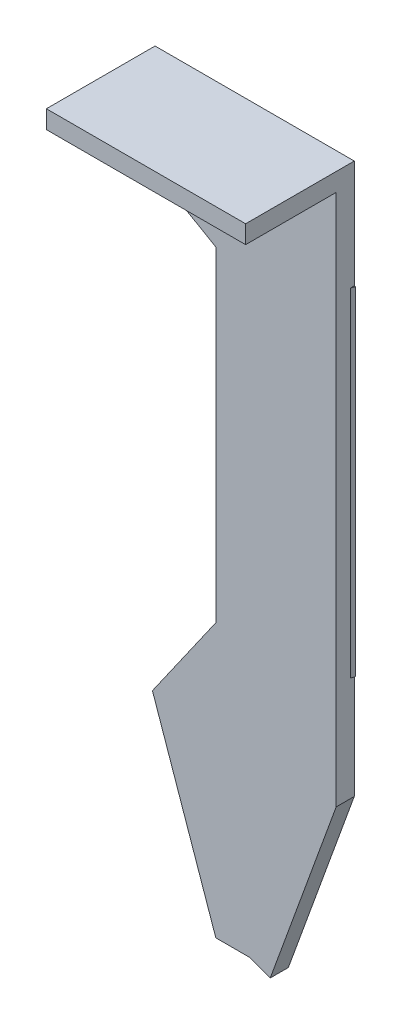
ISO-10303-21;
HEADER;
FILE_DESCRIPTION(('STEP AP214'),'2;1');
FILE_NAME('part.step','',(''),(''),'','','');
FILE_SCHEMA(('AUTOMOTIVE_DESIGN { 1 0 10303 214 1 1 1 1 }'));
ENDSEC;
DATA;
#1=APPLICATION_CONTEXT('core data for automotive mechanical design processes');
#2=APPLICATION_PROTOCOL_DEFINITION('international standard','automotive_design',2000,#1);
#3=PRODUCT_CONTEXT('',#1,'mechanical');
#4=PRODUCT('Part','Part','',(#3));
#5=PRODUCT_RELATED_PRODUCT_CATEGORY('part','',(#4));
#6=PRODUCT_DEFINITION_FORMATION('','',#4);
#7=PRODUCT_DEFINITION_CONTEXT('part definition',#1,'design');
#8=PRODUCT_DEFINITION('design','',#6,#7);
#9=PRODUCT_DEFINITION_SHAPE('','',#8);
#10=(LENGTH_UNIT() NAMED_UNIT(*) SI_UNIT(.MILLI.,.METRE.));
#11=(NAMED_UNIT(*) PLANE_ANGLE_UNIT() SI_UNIT($,.RADIAN.));
#12=(NAMED_UNIT(*) SI_UNIT($,.STERADIAN.) SOLID_ANGLE_UNIT());
#13=UNCERTAINTY_MEASURE_WITH_UNIT(LENGTH_MEASURE(1.E-05),#10,'distance_accuracy_value','');
#14=(GEOMETRIC_REPRESENTATION_CONTEXT(3) GLOBAL_UNCERTAINTY_ASSIGNED_CONTEXT((#13)) GLOBAL_UNIT_ASSIGNED_CONTEXT((#10,
#11,#12)) REPRESENTATION_CONTEXT('',''));
#15=CARTESIAN_POINT('',(0.,0.,0.));
#16=DIRECTION('',(0.,0.,1.));
#17=DIRECTION('',(1.,0.,0.));
#18=AXIS2_PLACEMENT_3D('',#15,#16,#17);
#19=CARTESIAN_POINT('',(95.289553246,-32.363508327,33.5));
#20=DIRECTION('',(0.,0.,-1.));
#21=DIRECTION('',(-1.,0.,0.));
#22=AXIS2_PLACEMENT_3D('',#19,#20,#21);
#23=PLANE('',#22);
#24=DIRECTION('',(1.,0.,0.));
#25=VECTOR('',#24,1.);
#26=CARTESIAN_POINT('',(84.289553246,-32.363508327,33.5));
#27=LINE('',#26,#25);
#28=CARTESIAN_POINT('',(73.289553246,-32.3635083263106,33.5));
#29=VERTEX_POINT('',#28);
#30=CARTESIAN_POINT('',(95.289553246,-32.363508327,33.5));
#31=VERTEX_POINT('',#30);
#32=EDGE_CURVE('E151',#29,#31,#27,.T.);
#33=ORIENTED_EDGE('',*,*,#32,.T.);
#34=DIRECTION('',(0.,1.,0.));
#35=VECTOR('',#34,1.);
#36=CARTESIAN_POINT('',(95.289553246,-60.748418779,33.5));
#37=LINE('',#36,#35);
#38=CARTESIAN_POINT('',(95.289553246,-30.363508327,33.5));
#39=VERTEX_POINT('',#38);
#40=EDGE_CURVE('E145',#31,#39,#37,.T.);
#41=ORIENTED_EDGE('',*,*,#40,.T.);
#42=DIRECTION('',(1.,0.,0.));
#43=VECTOR('',#42,1.);
#44=CARTESIAN_POINT('',(84.289553246,-30.363508327,33.5));
#45=LINE('',#44,#43);
#46=CARTESIAN_POINT('',(73.289553246,-30.363508327,33.5));
#47=VERTEX_POINT('',#46);
#48=EDGE_CURVE('E197',#47,#39,#45,.T.);
#49=ORIENTED_EDGE('',*,*,#48,.F.);
#50=DIRECTION('',(0.,-1.,0.));
#51=VECTOR('',#50,1.);
#52=CARTESIAN_POINT('',(73.289553246,-34.2040161205,33.5));
#53=LINE('',#52,#51);
#54=EDGE_CURVE('E177',#47,#29,#53,.T.);
#55=ORIENTED_EDGE('',*,*,#54,.T.);
#56=EDGE_LOOP('',(#33,#41,#49,#55));
#57=FACE_BOUND('',#56,.T.);
#58=ADVANCED_FACE('F19',(#57),#23,.F.);
#59=CARTESIAN_POINT('',(95.437373304,-79.599792462,21.895386265));
#60=DIRECTION('',(0.,1.,0.));
#61=DIRECTION('',(0.,0.,-1.));
#62=AXIS2_PLACEMENT_3D('',#59,#60,#61);
#63=PLANE('',#62);
#64=DIRECTION('',(1.,0.,0.));
#65=VECTOR('',#64,1.);
#66=CARTESIAN_POINT('',(84.3630224595,-79.5997924755307,21.5));
#67=LINE('',#66,#65);
#68=CARTESIAN_POINT('',(95.2895532471578,-79.5997924716139,21.5));
#69=VERTEX_POINT('',#68);
#70=CARTESIAN_POINT('',(95.4364916730518,-79.5997924687654,21.5));
#71=VERTEX_POINT('',#70);
#72=EDGE_CURVE('E242',#69,#71,#67,.T.);
#73=ORIENTED_EDGE('',*,*,#72,.T.);
#74=CARTESIAN_POINT('',(93.5,-79.599792462,20.9999999999999));
#75=DIRECTION('',(0.,-1.,0.));
#76=DIRECTION('',(0.,0.,-1.));
#77=AXIS2_PLACEMENT_3D('',#74,#75,#76);
#78=CIRCLE('',#77,2.);
#79=CARTESIAN_POINT('',(95.289553246,-79.5997924662727,21.8930280938559));
#80=VERTEX_POINT('',#79);
#81=EDGE_CURVE('E399',#71,#80,#78,.T.);
#82=ORIENTED_EDGE('',*,*,#81,.T.);
#83=DIRECTION('',(0.,0.,-1.));
#84=VECTOR('',#83,1.);
#85=CARTESIAN_POINT('',(95.289553246,-79.5997924705455,27.5));
#86=LINE('',#85,#84);
#87=EDGE_CURVE('E209',#80,#69,#86,.T.);
#88=ORIENTED_EDGE('',*,*,#87,.T.);
#89=EDGE_LOOP('',(#73,#82,#88));
#90=FACE_BOUND('',#89,.T.);
#91=ADVANCED_FACE('F814',(#90),#63,.F.);
#92=CARTESIAN_POINT('',(93.5,-42.3,21.));
#93=DIRECTION('',(0.,-1.,0.));
#94=DIRECTION('',(0.,0.,-1.));
#95=AXIS2_PLACEMENT_3D('',#92,#93,#94);
#96=CYLINDRICAL_SURFACE('',#95,2.);
#97=DIRECTION('',(0.,-1.,0.));
#98=VECTOR('',#97,1.);
#99=CARTESIAN_POINT('',(95.289553246,-60.748418779,21.893028092));
#100=LINE('',#99,#98);
#101=CARTESIAN_POINT('',(95.289553246,-42.2999999929639,21.893028093856));
#102=VERTEX_POINT('',#101);
#103=EDGE_CURVE('E204',#102,#80,#100,.T.);
#104=ORIENTED_EDGE('',*,*,#103,.T.);
#105=ORIENTED_EDGE('',*,*,#81,.F.);
#106=DIRECTION('',(0.,1.,0.));
#107=VECTOR('',#106,1.);
#108=CARTESIAN_POINT('',(95.436491673,-70.990728242,21.5));
#109=LINE('',#108,#107);
#110=CARTESIAN_POINT('',(95.4364916730518,-42.2999999842469,21.5));
#111=VERTEX_POINT('',#110);
#112=EDGE_CURVE('E633',#71,#111,#109,.T.);
#113=ORIENTED_EDGE('',*,*,#112,.T.);
#114=CARTESIAN_POINT('',(93.5,-42.3,21.));
#115=DIRECTION('',(0.,-1.,0.));
#116=DIRECTION('',(0.,0.,-1.));
#117=AXIS2_PLACEMENT_3D('',#114,#115,#116);
#118=CIRCLE('',#117,2.);
#119=EDGE_CURVE('E201',#102,#111,#118,.F.);
#120=ORIENTED_EDGE('',*,*,#119,.F.);
#121=EDGE_LOOP('',(#104,#105,#113,#120));
#122=FACE_BOUND('',#121,.T.);
#123=ADVANCED_FACE('F827',(#122),#96,.T.);
#124=CARTESIAN_POINT('',(95.437373304,-42.3,21.895386265));
#125=DIRECTION('',(0.,1.,0.));
#126=DIRECTION('',(0.,0.,-1.));
#127=AXIS2_PLACEMENT_3D('',#124,#125,#126);
#128=PLANE('',#127);
#129=DIRECTION('',(0.,0.,1.));
#130=VECTOR('',#129,1.);
#131=CARTESIAN_POINT('',(95.289553246,-42.2999999859278,27.5));
#132=LINE('',#131,#130);
#133=CARTESIAN_POINT('',(95.2895532471578,-42.2999999743051,21.5));
#134=VERTEX_POINT('',#133);
#135=EDGE_CURVE('E210',#134,#102,#132,.T.);
#136=ORIENTED_EDGE('',*,*,#135,.T.);
#137=ORIENTED_EDGE('',*,*,#119,.T.);
#138=DIRECTION('',(-1.,0.,0.));
#139=VECTOR('',#138,1.);
#140=CARTESIAN_POINT('',(84.3630224595,-42.2999999684937,21.5));
#141=LINE('',#140,#139);
#142=EDGE_CURVE('E348',#111,#134,#141,.T.);
#143=ORIENTED_EDGE('',*,*,#142,.T.);
#144=EDGE_LOOP('',(#136,#137,#143));
#145=FACE_BOUND('',#144,.T.);
#146=ADVANCED_FACE('F839',(#145),#128,.T.);
#147=CARTESIAN_POINT('',(73.289553246,-30.363508327,21.5));
#148=DIRECTION('',(0.,1.,0.));
#149=DIRECTION('',(0.,0.,1.));
#150=AXIS2_PLACEMENT_3D('',#147,#148,#149);
#151=PLANE('',#150);
#152=DIRECTION('',(0.,0.,-1.));
#153=VECTOR('',#152,1.);
#154=CARTESIAN_POINT('',(95.289553246,-30.363508327,27.5));
#155=LINE('',#154,#153);
#156=CARTESIAN_POINT('',(95.2895532471578,-30.363508327,21.5));
#157=VERTEX_POINT('',#156);
#158=EDGE_CURVE('E316',#39,#157,#155,.T.);
#159=ORIENTED_EDGE('',*,*,#158,.T.);
#160=DIRECTION('',(-1.,0.,0.));
#161=VECTOR('',#160,1.);
#162=CARTESIAN_POINT('',(84.3630224595,-30.363508327,21.5));
#163=LINE('',#162,#161);
#164=CARTESIAN_POINT('',(73.289553246,-30.363508327,21.5));
#165=VERTEX_POINT('',#164);
#166=EDGE_CURVE('E607',#157,#165,#163,.T.);
#167=ORIENTED_EDGE('',*,*,#166,.T.);
#168=DIRECTION('',(0.,0.,1.));
#169=VECTOR('',#168,1.);
#170=CARTESIAN_POINT('',(73.289553246,-30.363508327,27.5));
#171=LINE('',#170,#169);
#172=EDGE_CURVE('E294',#165,#47,#171,.T.);
#173=ORIENTED_EDGE('',*,*,#172,.T.);
#174=ORIENTED_EDGE('',*,*,#48,.T.);
#175=EDGE_LOOP('',(#159,#167,#173,#174));
#176=FACE_BOUND('',#175,.T.);
#177=ADVANCED_FACE('F851',(#176),#151,.T.);
#178=CARTESIAN_POINT('',(95.289553246,-91.133329231,21.5));
#179=DIRECTION('',(-1.,0.,0.));
#180=DIRECTION('',(0.,0.,1.));
#181=AXIS2_PLACEMENT_3D('',#178,#179,#180);
#182=PLANE('',#181);
#183=ORIENTED_EDGE('',*,*,#87,.F.);
#184=ORIENTED_EDGE('',*,*,#103,.F.);
#185=ORIENTED_EDGE('',*,*,#135,.F.);
#186=DIRECTION('',(0.,1.,0.));
#187=VECTOR('',#186,1.);
#188=CARTESIAN_POINT('',(95.2895532477368,-70.990728242,21.5));
#189=LINE('',#188,#187);
#190=EDGE_CURVE('E362',#134,#157,#189,.T.);
#191=ORIENTED_EDGE('',*,*,#190,.T.);
#192=ORIENTED_EDGE('',*,*,#158,.F.);
#193=ORIENTED_EDGE('',*,*,#40,.F.);
#194=DIRECTION('',(0.,0.,-1.));
#195=VECTOR('',#194,1.);
#196=CARTESIAN_POINT('',(95.289553246,-32.363508327,28.5));
#197=LINE('',#196,#195);
#198=CARTESIAN_POINT('',(95.289553246,-32.363508327,23.5));
#199=VERTEX_POINT('',#198);
#200=EDGE_CURVE('E140',#31,#199,#197,.T.);
#201=ORIENTED_EDGE('',*,*,#200,.T.);
#202=DIRECTION('',(0.,-1.,0.));
#203=VECTOR('',#202,1.);
#204=CARTESIAN_POINT('',(95.289553246,-71.984728242,23.5));
#205=LINE('',#204,#203);
#206=CARTESIAN_POINT('',(95.289553246,-91.133329231,23.5));
#207=VERTEX_POINT('',#206);
#208=EDGE_CURVE('E128',#199,#207,#205,.T.);
#209=ORIENTED_EDGE('',*,*,#208,.T.);
#210=DIRECTION('',(0.,0.,1.));
#211=VECTOR('',#210,1.);
#212=CARTESIAN_POINT('',(95.289553246,-91.133329231,22.5));
#213=LINE('',#212,#211);
#214=CARTESIAN_POINT('',(95.2895532468684,-91.1333292286142,21.5));
#215=VERTEX_POINT('',#214);
#216=EDGE_CURVE('E743',#215,#207,#213,.T.);
#217=ORIENTED_EDGE('',*,*,#216,.F.);
#218=DIRECTION('',(0.,1.,0.));
#219=VECTOR('',#218,1.);
#220=CARTESIAN_POINT('',(95.2895532477368,-70.990728242,21.5));
#221=LINE('',#220,#219);
#222=EDGE_CURVE('E244',#215,#69,#221,.T.);
#223=ORIENTED_EDGE('',*,*,#222,.T.);
#224=EDGE_LOOP('',(#183,#184,#185,#191,#192,#193,#201,#209,#217,#223));
#225=FACE_BOUND('',#224,.T.);
#226=ADVANCED_FACE('F142',(#225),#182,.F.);
#227=CARTESIAN_POINT('',(88.01014856,-111.133329231,21.5));
#228=DIRECTION('',(0.939692620775701,-0.342020143353713,0.));
#229=DIRECTION('',(0.342020143353713,0.939692620775701,0.));
#230=AXIS2_PLACEMENT_3D('',#227,#228,#229);
#231=PLANE('',#230);
#232=DIRECTION('',(0.342020143353713,0.939692620775701,0.));
#233=VECTOR('',#232,1.);
#234=CARTESIAN_POINT('',(88.01014856,-111.133329231,23.5));
#235=LINE('',#234,#233);
#236=CARTESIAN_POINT('',(88.01014856,-111.133329231,23.5));
#237=VERTEX_POINT('',#236);
#238=EDGE_CURVE('E134',#207,#237,#235,.F.);
#239=ORIENTED_EDGE('',*,*,#238,.T.);
#240=DIRECTION('',(0.,0.,1.));
#241=VECTOR('',#240,1.);
#242=CARTESIAN_POINT('',(88.01014856,-111.133329231,22.5));
#243=LINE('',#242,#241);
#244=CARTESIAN_POINT('',(88.01014856,-111.133329231,21.5));
#245=VERTEX_POINT('',#244);
#246=EDGE_CURVE('E735',#245,#237,#243,.T.);
#247=ORIENTED_EDGE('',*,*,#246,.F.);
#248=DIRECTION('',(0.342020143353713,0.939692620775701,0.));
#249=VECTOR('',#248,1.);
#250=CARTESIAN_POINT('',(88.01014856,-111.133329231,21.5));
#251=LINE('',#250,#249);
#252=EDGE_CURVE('E377',#245,#215,#251,.T.);
#253=ORIENTED_EDGE('',*,*,#252,.T.);
#254=ORIENTED_EDGE('',*,*,#216,.T.);
#255=EDGE_LOOP('',(#239,#247,#253,#254));
#256=FACE_BOUND('',#255,.T.);
#257=ADVANCED_FACE('F874',(#256),#231,.T.);
#258=CARTESIAN_POINT('',(88.01014856,-111.133329231,23.5));
#259=DIRECTION('',(-0.342020143344667,-0.939692620778993,0.));
#260=DIRECTION('',(-0.939692620778993,0.342020143344667,0.));
#261=AXIS2_PLACEMENT_3D('',#258,#259,#260);
#262=PLANE('',#261);
#263=DIRECTION('',(-0.939692620778993,0.342020143344667,0.));
#264=VECTOR('',#263,1.);
#265=CARTESIAN_POINT('',(88.01014856,-111.133329231,23.5));
#266=LINE('',#265,#264);
#267=CARTESIAN_POINT('',(85.7205953444996,-110.300000010737,23.5));
#268=VERTEX_POINT('',#267);
#269=EDGE_CURVE('E474',#237,#268,#266,.T.);
#270=ORIENTED_EDGE('',*,*,#269,.T.);
#271=DIRECTION('',(0.,0.,1.));
#272=VECTOR('',#271,1.);
#273=CARTESIAN_POINT('',(85.720595315,-110.3,22.5));
#274=LINE('',#273,#272);
#275=CARTESIAN_POINT('',(85.7205953224116,-110.300000002698,21.5));
#276=VERTEX_POINT('',#275);
#277=EDGE_CURVE('E180',#276,#268,#274,.T.);
#278=ORIENTED_EDGE('',*,*,#277,.F.);
#279=DIRECTION('',(-0.939692620778993,0.342020143344667,0.));
#280=VECTOR('',#279,1.);
#281=CARTESIAN_POINT('',(88.01014856,-111.133329231,21.5));
#282=LINE('',#281,#280);
#283=EDGE_CURVE('E486',#276,#245,#282,.F.);
#284=ORIENTED_EDGE('',*,*,#283,.T.);
#285=ORIENTED_EDGE('',*,*,#246,.T.);
#286=EDGE_LOOP('',(#270,#278,#284,#285));
#287=FACE_BOUND('',#286,.T.);
#288=ADVANCED_FACE('F885',(#287),#262,.T.);
#289=CARTESIAN_POINT('',(85.720595315,-110.3,23.5));
#290=DIRECTION('',(0.,-1.,0.));
#291=DIRECTION('',(-1.,0.,0.));
#292=AXIS2_PLACEMENT_3D('',#289,#290,#291);
#293=PLANE('',#292);
#294=DIRECTION('',(-1.,0.,0.));
#295=VECTOR('',#294,1.);
#296=CARTESIAN_POINT('',(84.289553246,-110.300000021474,23.5));
#297=LINE('',#296,#295);
#298=CARTESIAN_POINT('',(82.0000000000132,-110.3,23.5));
#299=VERTEX_POINT('',#298);
#300=EDGE_CURVE('E469',#268,#299,#297,.T.);
#301=ORIENTED_EDGE('',*,*,#300,.T.);
#302=DIRECTION('',(0.,0.,-1.));
#303=VECTOR('',#302,1.);
#304=CARTESIAN_POINT('',(82.0000000000132,-110.3,23.5));
#305=LINE('',#304,#303);
#306=CARTESIAN_POINT('',(82.0000000000132,-110.3,21.5));
#307=VERTEX_POINT('',#306);
#308=EDGE_CURVE('E392',#299,#307,#305,.T.);
#309=ORIENTED_EDGE('',*,*,#308,.T.);
#310=DIRECTION('',(1.,0.,0.));
#311=VECTOR('',#310,1.);
#312=CARTESIAN_POINT('',(84.3630224595,-110.300000005395,21.5));
#313=LINE('',#312,#311);
#314=EDGE_CURVE('E482',#307,#276,#313,.T.);
#315=ORIENTED_EDGE('',*,*,#314,.T.);
#316=ORIENTED_EDGE('',*,*,#277,.T.);
#317=EDGE_LOOP('',(#301,#309,#315,#316));
#318=FACE_BOUND('',#317,.T.);
#319=ADVANCED_FACE('F510',(#318),#293,.T.);
#320=CARTESIAN_POINT('',(75.251803773,-90.883762014,23.5));
#321=DIRECTION('',(0.944576438528157,0.328291565193902,0.));
#322=DIRECTION('',(0.328291565193902,-0.944576438528157,0.));
#323=AXIS2_PLACEMENT_3D('',#320,#321,#322);
#324=PLANE('',#323);
#325=DIRECTION('',(0.328291565193902,-0.944576438528157,0.));
#326=VECTOR('',#325,1.);
#327=CARTESIAN_POINT('',(75.251803773,-90.883762014,21.5));
#328=LINE('',#327,#326);
#329=CARTESIAN_POINT('',(74.9999999998163,-90.1592599661289,21.5));
#330=VERTEX_POINT('',#329);
#331=EDGE_CURVE('E455',#330,#307,#328,.T.);
#332=ORIENTED_EDGE('',*,*,#331,.T.);
#333=ORIENTED_EDGE('',*,*,#308,.F.);
#334=DIRECTION('',(0.328291565193902,-0.944576438528157,0.));
#335=VECTOR('',#334,1.);
#336=CARTESIAN_POINT('',(75.251803773,-90.883762014,23.5));
#337=LINE('',#336,#335);
#338=CARTESIAN_POINT('',(74.9999999998163,-90.1592599661289,23.5));
#339=VERTEX_POINT('',#338);
#340=EDGE_CURVE('E473',#299,#339,#337,.F.);
#341=ORIENTED_EDGE('',*,*,#340,.T.);
#342=DIRECTION('',(0.,0.,1.));
#343=VECTOR('',#342,1.);
#344=CARTESIAN_POINT('',(74.9999999998163,-90.1592599661289,23.5));
#345=LINE('',#344,#343);
#346=EDGE_CURVE('E165',#339,#330,#345,.F.);
#347=ORIENTED_EDGE('',*,*,#346,.T.);
#348=EDGE_LOOP('',(#332,#333,#341,#347));
#349=FACE_BOUND('',#348,.T.);
#350=ADVANCED_FACE('F503',(#349),#324,.F.);
#351=CARTESIAN_POINT('',(81.638304089,-80.678779214,23.5));
#352=DIRECTION('',(0.819152044260943,-0.573576436391104,0.));
#353=DIRECTION('',(-0.573576436391104,-0.819152044260943,0.));
#354=AXIS2_PLACEMENT_3D('',#351,#352,#353);
#355=PLANE('',#354);
#356=DIRECTION('',(-0.573576436391104,-0.819152044260943,0.));
#357=VECTOR('',#356,1.);
#358=CARTESIAN_POINT('',(81.638304089,-80.678779214,21.5));
#359=LINE('',#358,#357);
#360=CARTESIAN_POINT('',(82.,-80.1622239197122,21.5));
#361=VERTEX_POINT('',#360);
#362=EDGE_CURVE('E451',#361,#330,#359,.T.);
#363=ORIENTED_EDGE('',*,*,#362,.T.);
#364=ORIENTED_EDGE('',*,*,#346,.F.);
#365=DIRECTION('',(-0.573576436391104,-0.819152044260943,0.));
#366=VECTOR('',#365,1.);
#367=CARTESIAN_POINT('',(81.638304089,-80.678779214,23.5));
#368=LINE('',#367,#366);
#369=CARTESIAN_POINT('',(82.,-80.1622239197123,23.5));
#370=VERTEX_POINT('',#369);
#371=EDGE_CURVE('E551',#339,#370,#368,.F.);
#372=ORIENTED_EDGE('',*,*,#371,.T.);
#373=DIRECTION('',(0.,0.,-1.));
#374=VECTOR('',#373,1.);
#375=CARTESIAN_POINT('',(82.,-80.1622239197123,23.5));
#376=LINE('',#375,#374);
#377=EDGE_CURVE('E157',#370,#361,#376,.T.);
#378=ORIENTED_EDGE('',*,*,#377,.T.);
#379=EDGE_LOOP('',(#363,#364,#372,#378));
#380=FACE_BOUND('',#379,.T.);
#381=ADVANCED_FACE('F918',(#380),#355,.F.);
#382=CARTESIAN_POINT('',(82.,-45.382903769,23.5));
#383=DIRECTION('',(1.,0.,0.));
#384=DIRECTION('',(0.,-1.,0.));
#385=AXIS2_PLACEMENT_3D('',#382,#383,#384);
#386=PLANE('',#385);
#387=DIRECTION('',(0.,1.,0.));
#388=VECTOR('',#387,1.);
#389=CARTESIAN_POINT('',(82.000000002,-71.984728242,23.5));
#390=LINE('',#389,#388);
#391=CARTESIAN_POINT('',(82.,-44.2282032302188,23.5));
#392=VERTEX_POINT('',#391);
#393=EDGE_CURVE('E260',#370,#392,#390,.T.);
#394=ORIENTED_EDGE('',*,*,#393,.T.);
#395=DIRECTION('',(0.,0.,-1.));
#396=VECTOR('',#395,1.);
#397=CARTESIAN_POINT('',(82.,-44.2282032302188,23.5));
#398=LINE('',#397,#396);
#399=CARTESIAN_POINT('',(82.,-44.2282032302188,21.5));
#400=VERTEX_POINT('',#399);
#401=EDGE_CURVE('E27',#392,#400,#398,.T.);
#402=ORIENTED_EDGE('',*,*,#401,.T.);
#403=DIRECTION('',(0.,-1.,0.));
#404=VECTOR('',#403,1.);
#405=CARTESIAN_POINT('',(82.0000000060648,-70.990728242,21.5));
#406=LINE('',#405,#404);
#407=EDGE_CURVE('E150',#400,#361,#406,.T.);
#408=ORIENTED_EDGE('',*,*,#407,.T.);
#409=ORIENTED_EDGE('',*,*,#377,.F.);
#410=EDGE_LOOP('',(#394,#402,#408,#409));
#411=FACE_BOUND('',#410,.T.);
#412=ADVANCED_FACE('F929',(#411),#386,.F.);
#413=CARTESIAN_POINT('',(74.289553246,-39.776574721,23.5));
#414=DIRECTION('',(0.500000000018918,0.866025403773516,0.));
#415=DIRECTION('',(0.866025403773516,-0.500000000018918,0.));
#416=AXIS2_PLACEMENT_3D('',#413,#414,#415);
#417=PLANE('',#416);
#418=DIRECTION('',(0.866025403773516,-0.500000000018918,0.));
#419=VECTOR('',#418,1.);
#420=CARTESIAN_POINT('',(74.289553246,-39.776574721,23.5));
#421=LINE('',#420,#419);
#422=CARTESIAN_POINT('',(73.289553246,-39.1992244517813,23.5));
#423=VERTEX_POINT('',#422);
#424=EDGE_CURVE('E167',#392,#423,#421,.F.);
#425=ORIENTED_EDGE('',*,*,#424,.T.);
#426=DIRECTION('',(0.,0.,1.));
#427=VECTOR('',#426,1.);
#428=CARTESIAN_POINT('',(73.289553246,-39.1992244517813,33.5));
#429=LINE('',#428,#427);
#430=CARTESIAN_POINT('',(73.289553246,-39.1992244517813,21.5));
#431=VERTEX_POINT('',#430);
#432=EDGE_CURVE('E12',#423,#431,#429,.F.);
#433=ORIENTED_EDGE('',*,*,#432,.T.);
#434=DIRECTION('',(0.866025403773516,-0.500000000018918,0.));
#435=VECTOR('',#434,1.);
#436=CARTESIAN_POINT('',(74.289553246,-39.776574721,21.5));
#437=LINE('',#436,#435);
#438=EDGE_CURVE('E137',#431,#400,#437,.T.);
#439=ORIENTED_EDGE('',*,*,#438,.T.);
#440=ORIENTED_EDGE('',*,*,#401,.F.);
#441=EDGE_LOOP('',(#425,#433,#439,#440));
#442=FACE_BOUND('',#441,.T.);
#443=ADVANCED_FACE('F941',(#442),#417,.F.);
#444=CARTESIAN_POINT('',(73.289553246,-38.044523914,33.5));
#445=DIRECTION('',(1.,0.,0.));
#446=DIRECTION('',(0.,0.,-1.));
#447=AXIS2_PLACEMENT_3D('',#444,#445,#446);
#448=PLANE('',#447);
#449=DIRECTION('',(0.,-1.,0.));
#450=VECTOR('',#449,1.);
#451=CARTESIAN_POINT('',(73.289553246,-70.990728242,21.5));
#452=LINE('',#451,#450);
#453=EDGE_CURVE('E34',#165,#431,#452,.T.);
#454=ORIENTED_EDGE('',*,*,#453,.T.);
#455=ORIENTED_EDGE('',*,*,#432,.F.);
#456=DIRECTION('',(0.,1.,0.));
#457=VECTOR('',#456,1.);
#458=CARTESIAN_POINT('',(73.289553246,-71.984728242,23.5));
#459=LINE('',#458,#457);
#460=CARTESIAN_POINT('',(73.289553246,-32.363508327,23.5));
#461=VERTEX_POINT('',#460);
#462=EDGE_CURVE('E42',#423,#461,#459,.T.);
#463=ORIENTED_EDGE('',*,*,#462,.T.);
#464=DIRECTION('',(0.,0.,1.));
#465=VECTOR('',#464,1.);
#466=CARTESIAN_POINT('',(73.289553246,-32.363508327,28.5));
#467=LINE('',#466,#465);
#468=EDGE_CURVE('E155',#461,#29,#467,.T.);
#469=ORIENTED_EDGE('',*,*,#468,.T.);
#470=ORIENTED_EDGE('',*,*,#54,.F.);
#471=ORIENTED_EDGE('',*,*,#172,.F.);
#472=EDGE_LOOP('',(#454,#455,#463,#469,#470,#471));
#473=FACE_BOUND('',#472,.T.);
#474=ADVANCED_FACE('F954',(#473),#448,.F.);
#475=CARTESIAN_POINT('',(73.289553246,-32.363508327,23.5));
#476=DIRECTION('',(0.,1.,0.));
#477=DIRECTION('',(0.,0.,1.));
#478=AXIS2_PLACEMENT_3D('',#475,#476,#477);
#479=PLANE('',#478);
#480=ORIENTED_EDGE('',*,*,#200,.F.);
#481=ORIENTED_EDGE('',*,*,#32,.F.);
#482=ORIENTED_EDGE('',*,*,#468,.F.);
#483=DIRECTION('',(1.,0.,0.));
#484=VECTOR('',#483,1.);
#485=CARTESIAN_POINT('',(84.289553246,-32.363508327,23.5));
#486=LINE('',#485,#484);
#487=EDGE_CURVE('E131',#461,#199,#486,.T.);
#488=ORIENTED_EDGE('',*,*,#487,.T.);
#489=EDGE_LOOP('',(#480,#481,#482,#488));
#490=FACE_BOUND('',#489,.T.);
#491=ADVANCED_FACE('F153',(#490),#479,.F.);
#492=CARTESIAN_POINT('',(73.289553246,-30.363508327,21.5));
#493=DIRECTION('',(0.,0.,1.));
#494=DIRECTION('',(0.,-1.,0.));
#495=AXIS2_PLACEMENT_3D('',#492,#493,#494);
#496=PLANE('',#495);
#497=ORIENTED_EDGE('',*,*,#438,.F.);
#498=ORIENTED_EDGE('',*,*,#453,.F.);
#499=ORIENTED_EDGE('',*,*,#166,.F.);
#500=ORIENTED_EDGE('',*,*,#190,.F.);
#501=ORIENTED_EDGE('',*,*,#142,.F.);
#502=ORIENTED_EDGE('',*,*,#112,.F.);
#503=ORIENTED_EDGE('',*,*,#72,.F.);
#504=ORIENTED_EDGE('',*,*,#222,.F.);
#505=ORIENTED_EDGE('',*,*,#252,.F.);
#506=ORIENTED_EDGE('',*,*,#283,.F.);
#507=ORIENTED_EDGE('',*,*,#314,.F.);
#508=ORIENTED_EDGE('',*,*,#331,.F.);
#509=ORIENTED_EDGE('',*,*,#362,.F.);
#510=ORIENTED_EDGE('',*,*,#407,.F.);
#511=EDGE_LOOP('',(#497,#498,#499,#500,#501,#502,#503,#504,#505,#506,#507,#508,#509,#510));
#512=FACE_BOUND('',#511,.T.);
#513=ADVANCED_FACE('F508',(#512),#496,.F.);
#514=CARTESIAN_POINT('',(95.289553246,-111.605948157,23.5));
#515=DIRECTION('',(0.,0.,-1.));
#516=DIRECTION('',(-1.,0.,0.));
#517=AXIS2_PLACEMENT_3D('',#514,#515,#516);
#518=PLANE('',#517);
#519=ORIENTED_EDGE('',*,*,#462,.F.);
#520=ORIENTED_EDGE('',*,*,#424,.F.);
#521=ORIENTED_EDGE('',*,*,#393,.F.);
#522=ORIENTED_EDGE('',*,*,#371,.F.);
#523=ORIENTED_EDGE('',*,*,#340,.F.);
#524=ORIENTED_EDGE('',*,*,#300,.F.);
#525=ORIENTED_EDGE('',*,*,#269,.F.);
#526=ORIENTED_EDGE('',*,*,#238,.F.);
#527=ORIENTED_EDGE('',*,*,#208,.F.);
#528=ORIENTED_EDGE('',*,*,#487,.F.);
#529=EDGE_LOOP('',(#519,#520,#521,#522,#523,#524,#525,#526,#527,#528));
#530=FACE_BOUND('',#529,.T.);
#531=ADVANCED_FACE('F21',(#530),#518,.F.);
#532=CLOSED_SHELL('',(#58,#91,#123,#146,#177,#226,#257,#288,#319,#350,#381,#412,#443,#474,#491,
#513,#531));
#533=MANIFOLD_SOLID_BREP('B1',#532);
#534=ADVANCED_BREP_SHAPE_REPRESENTATION('',(#18,#533),#14);
#535=SHAPE_DEFINITION_REPRESENTATION(#9,#534);
ENDSEC;
END-ISO-10303-21;
